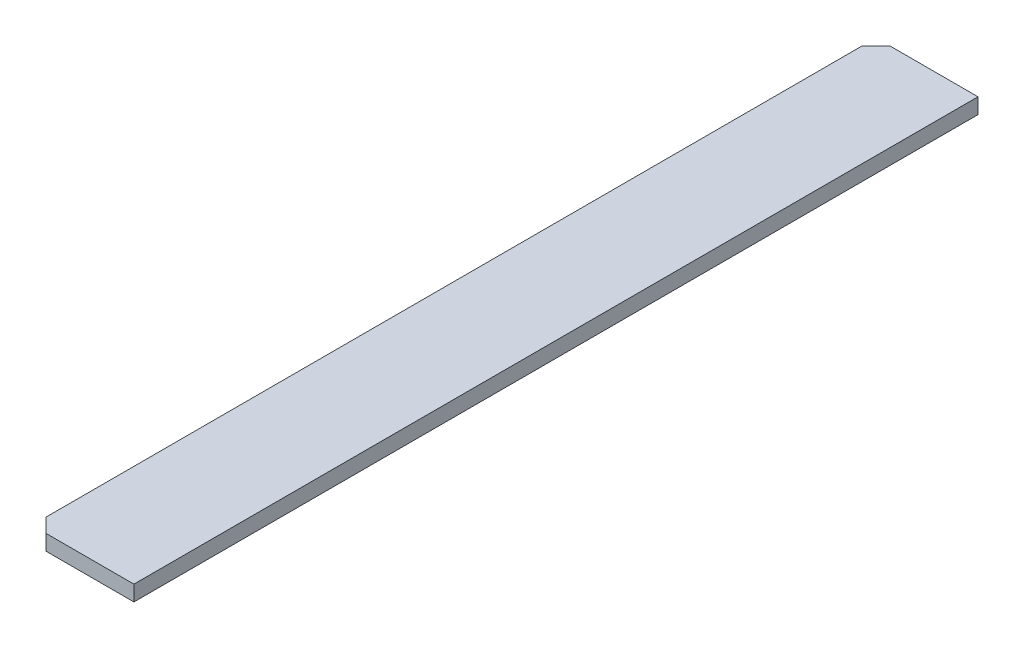
ISO-10303-21;
HEADER;
FILE_DESCRIPTION(('STEP AP214'),'2;1');
FILE_NAME('part.step','',(''),(''),'','','');
FILE_SCHEMA(('AUTOMOTIVE_DESIGN { 1 0 10303 214 1 1 1 1 }'));
ENDSEC;
DATA;
#1=APPLICATION_CONTEXT('core data for automotive mechanical design processes');
#2=APPLICATION_PROTOCOL_DEFINITION('international standard','automotive_design',2000,#1);
#3=PRODUCT_CONTEXT('',#1,'mechanical');
#4=PRODUCT('Part','Part','',(#3));
#5=PRODUCT_RELATED_PRODUCT_CATEGORY('part','',(#4));
#6=PRODUCT_DEFINITION_FORMATION('','',#4);
#7=PRODUCT_DEFINITION_CONTEXT('part definition',#1,'design');
#8=PRODUCT_DEFINITION('design','',#6,#7);
#9=PRODUCT_DEFINITION_SHAPE('','',#8);
#10=(LENGTH_UNIT() NAMED_UNIT(*) SI_UNIT(.MILLI.,.METRE.));
#11=(NAMED_UNIT(*) PLANE_ANGLE_UNIT() SI_UNIT($,.RADIAN.));
#12=(NAMED_UNIT(*) SI_UNIT($,.STERADIAN.) SOLID_ANGLE_UNIT());
#13=UNCERTAINTY_MEASURE_WITH_UNIT(LENGTH_MEASURE(1.E-05),#10,'distance_accuracy_value','');
#14=(GEOMETRIC_REPRESENTATION_CONTEXT(3) GLOBAL_UNCERTAINTY_ASSIGNED_CONTEXT((#13)) GLOBAL_UNIT_ASSIGNED_CONTEXT((#10,
#11,#12)) REPRESENTATION_CONTEXT('',''));
#15=CARTESIAN_POINT('',(0.,0.,0.));
#16=DIRECTION('',(0.,0.,1.));
#17=DIRECTION('',(1.,0.,0.));
#18=AXIS2_PLACEMENT_3D('',#15,#16,#17);
#19=CARTESIAN_POINT('',(-72.5000000000001,22.,-580.));
#20=DIRECTION('',(1.,0.,0.));
#21=DIRECTION('',(0.,0.,-1.));
#22=AXIS2_PLACEMENT_3D('',#19,#20,#21);
#23=PLANE('',#22);
#24=DIRECTION('',(0.,-0.632455532033672,-0.774596669241487));
#25=VECTOR('',#24,1.);
#26=CARTESIAN_POINT('',(-72.5,-58.0846922834923,-514.61112256588));
#27=LINE('',#26,#25);
#28=CARTESIAN_POINT('',(-72.4999999999976,10.9999999999999,-430.000000000003));
#29=VERTEX_POINT('',#28);
#30=CARTESIAN_POINT('',(-72.5,0.,-443.472193585314));
#31=VERTEX_POINT('',#30);
#32=EDGE_CURVE('E173',#29,#31,#27,.T.);
#33=ORIENTED_EDGE('',*,*,#32,.F.);
#34=DIRECTION('',(0.,0.,1.));
#35=VECTOR('',#34,1.);
#36=CARTESIAN_POINT('',(-72.4999999999976,10.9999999999999,-430.000000000003));
#37=LINE('',#36,#35);
#38=CARTESIAN_POINT('',(-72.4999999999976,10.9999999999999,-97.4999999999983));
#39=VERTEX_POINT('',#38);
#40=EDGE_CURVE('E130',#29,#39,#37,.T.);
#41=ORIENTED_EDGE('',*,*,#40,.T.);
#42=DIRECTION('',(0.,0.632455532033672,-0.774596669241487));
#43=VECTOR('',#42,1.);
#44=CARTESIAN_POINT('',(-72.5,251.775760178578,-392.388877434124));
#45=LINE('',#44,#43);
#46=CARTESIAN_POINT('',(-72.5,0.,-84.0278064146879));
#47=VERTEX_POINT('',#46);
#48=EDGE_CURVE('E120',#39,#47,#45,.F.);
#49=ORIENTED_EDGE('',*,*,#48,.T.);
#50=DIRECTION('',(0.,0.,1.));
#51=VECTOR('',#50,1.);
#52=CARTESIAN_POINT('',(-72.5000000000001,0.,-580.));
#53=LINE('',#52,#51);
#54=CARTESIAN_POINT('',(-72.5,0.,84.0278064146881));
#55=VERTEX_POINT('',#54);
#56=EDGE_CURVE('E128',#47,#55,#53,.T.);
#57=ORIENTED_EDGE('',*,*,#56,.T.);
#58=DIRECTION('',(0.,0.632455532033672,0.774596669241487));
#59=VECTOR('',#58,1.);
#60=CARTESIAN_POINT('',(-72.5,11.0000000000013,97.4999999999972));
#61=LINE('',#60,#59);
#62=CARTESIAN_POINT('',(-72.4999999999976,10.9999999999999,97.4999999999983));
#63=VERTEX_POINT('',#62);
#64=EDGE_CURVE('E167',#63,#55,#61,.F.);
#65=ORIENTED_EDGE('',*,*,#64,.F.);
#66=DIRECTION('',(0.,0.,-1.));
#67=VECTOR('',#66,1.);
#68=CARTESIAN_POINT('',(-72.4999999999976,10.9999999999999,430.000000000003));
#69=LINE('',#68,#67);
#70=CARTESIAN_POINT('',(-72.4999999999976,10.9999999999999,430.000000000003));
#71=VERTEX_POINT('',#70);
#72=EDGE_CURVE('E185',#71,#63,#69,.T.);
#73=ORIENTED_EDGE('',*,*,#72,.F.);
#74=DIRECTION('',(0.,-0.632455532033672,0.774596669241487));
#75=VECTOR('',#74,1.);
#76=CARTESIAN_POINT('',(-72.4999999999999,11.0000000000013,430.000000000004));
#77=LINE('',#76,#75);
#78=CARTESIAN_POINT('',(-72.4999999999999,0.,443.472193585314));
#79=VERTEX_POINT('',#78);
#80=EDGE_CURVE('E174',#71,#79,#77,.T.);
#81=ORIENTED_EDGE('',*,*,#80,.T.);
#82=CARTESIAN_POINT('',(-72.4999999999999,0.,580.));
#83=VERTEX_POINT('',#82);
#84=EDGE_CURVE('E138',#79,#83,#53,.T.);
#85=ORIENTED_EDGE('',*,*,#84,.T.);
#86=DIRECTION('',(0.,-1.,0.));
#87=VECTOR('',#86,1.);
#88=CARTESIAN_POINT('',(-72.4999999999999,22.,580.));
#89=LINE('',#88,#87);
#90=CARTESIAN_POINT('',(-72.4999999999999,22.,580.));
#91=VERTEX_POINT('',#90);
#92=EDGE_CURVE('E157',#91,#83,#89,.T.);
#93=ORIENTED_EDGE('',*,*,#92,.F.);
#94=DIRECTION('',(0.,0.,1.));
#95=VECTOR('',#94,1.);
#96=CARTESIAN_POINT('',(-72.5000000000001,22.,-580.));
#97=LINE('',#96,#95);
#98=CARTESIAN_POINT('',(-72.5000000000001,22.,-580.));
#99=VERTEX_POINT('',#98);
#100=EDGE_CURVE('E196',#99,#91,#97,.T.);
#101=ORIENTED_EDGE('',*,*,#100,.F.);
#102=DIRECTION('',(0.,-1.,0.));
#103=VECTOR('',#102,1.);
#104=CARTESIAN_POINT('',(-72.5000000000001,22.,-580.));
#105=LINE('',#104,#103);
#106=CARTESIAN_POINT('',(-72.5000000000001,0.,-580.));
#107=VERTEX_POINT('',#106);
#108=EDGE_CURVE('E160',#99,#107,#105,.T.);
#109=ORIENTED_EDGE('',*,*,#108,.T.);
#110=EDGE_CURVE('E137',#107,#31,#53,.T.);
#111=ORIENTED_EDGE('',*,*,#110,.T.);
#112=EDGE_LOOP('',(#33,#41,#49,#57,#65,#73,#81,#85,#93,#101,#109,#111));
#113=FACE_BOUND('',#112,.T.);
#114=ADVANCED_FACE('F32',(#113),#23,.F.);
#115=CARTESIAN_POINT('',(72.5000000000001,0.,600.));
#116=DIRECTION('',(0.,1.,0.));
#117=DIRECTION('',(0.,0.,1.));
#118=AXIS2_PLACEMENT_3D('',#115,#116,#117);
#119=PLANE('',#118);
#120=DIRECTION('',(0.632455532033676,0.,0.774596669241483));
#121=VECTOR('',#120,1.);
#122=CARTESIAN_POINT('',(496.694887013338,0.,253.646325106587));
#123=LINE('',#122,#121);
#124=CARTESIAN_POINT('',(-61.4999999999976,0.,-430.000000000003));
#125=VERTEX_POINT('',#124);
#126=EDGE_CURVE('E170',#31,#125,#123,.T.);
#127=ORIENTED_EDGE('',*,*,#126,.F.);
#128=ORIENTED_EDGE('',*,*,#110,.F.);
#129=DIRECTION('',(-0.707106781186547,0.,0.707106781186548));
#130=VECTOR('',#129,1.);
#131=CARTESIAN_POINT('',(-72.5000000000001,0.,-580.));
#132=LINE('',#131,#130);
#133=CARTESIAN_POINT('',(-52.5000000000001,0.,-600.));
#134=VERTEX_POINT('',#133);
#135=EDGE_CURVE('E142',#134,#107,#132,.T.);
#136=ORIENTED_EDGE('',*,*,#135,.F.);
#137=DIRECTION('',(-1.,0.,0.));
#138=VECTOR('',#137,1.);
#139=CARTESIAN_POINT('',(-52.5000000000001,0.,-600.));
#140=LINE('',#139,#138);
#141=CARTESIAN_POINT('',(72.4999999999999,0.,-600.));
#142=VERTEX_POINT('',#141);
#143=EDGE_CURVE('E83',#142,#134,#140,.T.);
#144=ORIENTED_EDGE('',*,*,#143,.F.);
#145=DIRECTION('',(0.,0.,-1.));
#146=VECTOR('',#145,1.);
#147=CARTESIAN_POINT('',(72.4999999999999,0.,-600.));
#148=LINE('',#147,#146);
#149=CARTESIAN_POINT('',(72.5000000000001,0.,600.));
#150=VERTEX_POINT('',#149);
#151=EDGE_CURVE('E187',#150,#142,#148,.T.);
#152=ORIENTED_EDGE('',*,*,#151,.F.);
#153=DIRECTION('',(1.,0.,0.));
#154=VECTOR('',#153,1.);
#155=CARTESIAN_POINT('',(-52.4999999999999,0.,600.));
#156=LINE('',#155,#154);
#157=CARTESIAN_POINT('',(-52.4999999999999,0.,600.));
#158=VERTEX_POINT('',#157);
#159=EDGE_CURVE('E147',#158,#150,#156,.T.);
#160=ORIENTED_EDGE('',*,*,#159,.F.);
#161=DIRECTION('',(0.707106781186547,0.,0.707106781186548));
#162=VECTOR('',#161,1.);
#163=CARTESIAN_POINT('',(-72.4999999999999,0.,580.));
#164=LINE('',#163,#162);
#165=EDGE_CURVE('E141',#83,#158,#164,.T.);
#166=ORIENTED_EDGE('',*,*,#165,.F.);
#167=ORIENTED_EDGE('',*,*,#84,.F.);
#168=DIRECTION('',(0.632455532033676,0.,-0.774596669241483));
#169=VECTOR('',#168,1.);
#170=CARTESIAN_POINT('',(-65.8999999999976,0.,435.388877434126));
#171=LINE('',#170,#169);
#172=CARTESIAN_POINT('',(-61.4999999999976,0.,430.000000000003));
#173=VERTEX_POINT('',#172);
#174=EDGE_CURVE('E36',#79,#173,#171,.T.);
#175=ORIENTED_EDGE('',*,*,#174,.T.);
#176=DIRECTION('',(0.,0.,-1.));
#177=VECTOR('',#176,1.);
#178=CARTESIAN_POINT('',(-61.4999999999976,0.,430.000000000003));
#179=LINE('',#178,#177);
#180=CARTESIAN_POINT('',(-61.4999999999976,0.,97.4999999999983));
#181=VERTEX_POINT('',#180);
#182=EDGE_CURVE('E75',#173,#181,#179,.T.);
#183=ORIENTED_EDGE('',*,*,#182,.T.);
#184=DIRECTION('',(-0.632455532033676,0.,-0.774596669241483));
#185=VECTOR('',#184,1.);
#186=CARTESIAN_POINT('',(-65.8999999999976,0.,92.1111225658753));
#187=LINE('',#186,#185);
#188=EDGE_CURVE('E136',#55,#181,#187,.F.);
#189=ORIENTED_EDGE('',*,*,#188,.F.);
#190=ORIENTED_EDGE('',*,*,#56,.F.);
#191=DIRECTION('',(-0.632455532033676,0.,0.774596669241483));
#192=VECTOR('',#191,1.);
#193=CARTESIAN_POINT('',(-349.603819118251,0.,255.353674893413));
#194=LINE('',#193,#192);
#195=CARTESIAN_POINT('',(-61.4999999999976,0.,-97.4999999999983));
#196=VERTEX_POINT('',#195);
#197=EDGE_CURVE('E117',#47,#196,#194,.F.);
#198=ORIENTED_EDGE('',*,*,#197,.T.);
#199=DIRECTION('',(0.,0.,1.));
#200=VECTOR('',#199,1.);
#201=CARTESIAN_POINT('',(-61.4999999999976,0.,-430.000000000003));
#202=LINE('',#201,#200);
#203=EDGE_CURVE('E180',#125,#196,#202,.T.);
#204=ORIENTED_EDGE('',*,*,#203,.F.);
#205=EDGE_LOOP('',(#127,#128,#136,#144,#152,#160,#166,#167,#175,#183,#189,#190,#198,#204));
#206=FACE_BOUND('',#205,.T.);
#207=ADVANCED_FACE('F135',(#206),#119,.F.);
#208=CARTESIAN_POINT('',(72.4999999999999,22.,-600.));
#209=DIRECTION('',(-1.,0.,0.));
#210=DIRECTION('',(0.,0.,1.));
#211=AXIS2_PLACEMENT_3D('',#208,#209,#210);
#212=PLANE('',#211);
#213=ORIENTED_EDGE('',*,*,#151,.T.);
#214=DIRECTION('',(0.,-1.,0.));
#215=VECTOR('',#214,1.);
#216=CARTESIAN_POINT('',(72.4999999999999,22.,-600.));
#217=LINE('',#216,#215);
#218=CARTESIAN_POINT('',(72.4999999999999,22.,-600.));
#219=VERTEX_POINT('',#218);
#220=EDGE_CURVE('E11',#219,#142,#217,.T.);
#221=ORIENTED_EDGE('',*,*,#220,.F.);
#222=DIRECTION('',(0.,0.,-1.));
#223=VECTOR('',#222,1.);
#224=CARTESIAN_POINT('',(72.4999999999999,22.,-600.));
#225=LINE('',#224,#223);
#226=CARTESIAN_POINT('',(72.5000000000001,22.,600.));
#227=VERTEX_POINT('',#226);
#228=EDGE_CURVE('E149',#227,#219,#225,.T.);
#229=ORIENTED_EDGE('',*,*,#228,.F.);
#230=DIRECTION('',(0.,-1.,0.));
#231=VECTOR('',#230,1.);
#232=CARTESIAN_POINT('',(72.5000000000001,22.,600.));
#233=LINE('',#232,#231);
#234=EDGE_CURVE('E150',#227,#150,#233,.T.);
#235=ORIENTED_EDGE('',*,*,#234,.T.);
#236=EDGE_LOOP('',(#213,#221,#229,#235));
#237=FACE_BOUND('',#236,.T.);
#238=ADVANCED_FACE('F237',(#237),#212,.F.);
#239=CARTESIAN_POINT('',(-52.5000000000001,22.,-600.));
#240=DIRECTION('',(0.,0.,1.));
#241=DIRECTION('',(1.,0.,0.));
#242=AXIS2_PLACEMENT_3D('',#239,#240,#241);
#243=PLANE('',#242);
#244=ORIENTED_EDGE('',*,*,#143,.T.);
#245=DIRECTION('',(0.,-1.,0.));
#246=VECTOR('',#245,1.);
#247=CARTESIAN_POINT('',(-52.5000000000001,22.,-600.));
#248=LINE('',#247,#246);
#249=CARTESIAN_POINT('',(-52.5000000000001,22.,-600.));
#250=VERTEX_POINT('',#249);
#251=EDGE_CURVE('E42',#250,#134,#248,.T.);
#252=ORIENTED_EDGE('',*,*,#251,.F.);
#253=DIRECTION('',(-1.,0.,0.));
#254=VECTOR('',#253,1.);
#255=CARTESIAN_POINT('',(-52.5000000000001,22.,-600.));
#256=LINE('',#255,#254);
#257=EDGE_CURVE('E190',#219,#250,#256,.T.);
#258=ORIENTED_EDGE('',*,*,#257,.F.);
#259=ORIENTED_EDGE('',*,*,#220,.T.);
#260=EDGE_LOOP('',(#244,#252,#258,#259));
#261=FACE_BOUND('',#260,.T.);
#262=ADVANCED_FACE('F245',(#261),#243,.F.);
#263=CARTESIAN_POINT('',(-72.5000000000001,22.,-580.));
#264=DIRECTION('',(0.707106781186548,0.,0.707106781186547));
#265=DIRECTION('',(0.707106781186547,0.,-0.707106781186548));
#266=AXIS2_PLACEMENT_3D('',#263,#264,#265);
#267=PLANE('',#266);
#268=ORIENTED_EDGE('',*,*,#135,.T.);
#269=ORIENTED_EDGE('',*,*,#108,.F.);
#270=DIRECTION('',(-0.707106781186547,0.,0.707106781186548));
#271=VECTOR('',#270,1.);
#272=CARTESIAN_POINT('',(-72.5000000000001,22.,-580.));
#273=LINE('',#272,#271);
#274=EDGE_CURVE('E193',#250,#99,#273,.T.);
#275=ORIENTED_EDGE('',*,*,#274,.F.);
#276=ORIENTED_EDGE('',*,*,#251,.T.);
#277=EDGE_LOOP('',(#268,#269,#275,#276));
#278=FACE_BOUND('',#277,.T.);
#279=ADVANCED_FACE('F209',(#278),#267,.F.);
#280=CARTESIAN_POINT('',(-72.4999999999999,22.,580.));
#281=DIRECTION('',(0.707106781186548,0.,-0.707106781186547));
#282=DIRECTION('',(-0.707106781186547,0.,-0.707106781186548));
#283=AXIS2_PLACEMENT_3D('',#280,#281,#282);
#284=PLANE('',#283);
#285=ORIENTED_EDGE('',*,*,#165,.T.);
#286=DIRECTION('',(0.,-1.,0.));
#287=VECTOR('',#286,1.);
#288=CARTESIAN_POINT('',(-52.4999999999999,22.,600.));
#289=LINE('',#288,#287);
#290=CARTESIAN_POINT('',(-52.4999999999999,22.,600.));
#291=VERTEX_POINT('',#290);
#292=EDGE_CURVE('E153',#291,#158,#289,.T.);
#293=ORIENTED_EDGE('',*,*,#292,.F.);
#294=DIRECTION('',(0.707106781186547,0.,0.707106781186548));
#295=VECTOR('',#294,1.);
#296=CARTESIAN_POINT('',(-72.4999999999999,22.,580.));
#297=LINE('',#296,#295);
#298=EDGE_CURVE('E199',#91,#291,#297,.T.);
#299=ORIENTED_EDGE('',*,*,#298,.F.);
#300=ORIENTED_EDGE('',*,*,#92,.T.);
#301=EDGE_LOOP('',(#285,#293,#299,#300));
#302=FACE_BOUND('',#301,.T.);
#303=ADVANCED_FACE('F241',(#302),#284,.F.);
#304=CARTESIAN_POINT('',(-52.4999999999999,22.,600.));
#305=DIRECTION('',(0.,0.,-1.));
#306=DIRECTION('',(-1.,0.,0.));
#307=AXIS2_PLACEMENT_3D('',#304,#305,#306);
#308=PLANE('',#307);
#309=ORIENTED_EDGE('',*,*,#159,.T.);
#310=ORIENTED_EDGE('',*,*,#234,.F.);
#311=DIRECTION('',(1.,0.,0.));
#312=VECTOR('',#311,1.);
#313=CARTESIAN_POINT('',(-52.4999999999999,22.,600.));
#314=LINE('',#313,#312);
#315=EDGE_CURVE('E154',#291,#227,#314,.T.);
#316=ORIENTED_EDGE('',*,*,#315,.F.);
#317=ORIENTED_EDGE('',*,*,#292,.T.);
#318=EDGE_LOOP('',(#309,#310,#316,#317));
#319=FACE_BOUND('',#318,.T.);
#320=ADVANCED_FACE('F299',(#319),#308,.F.);
#321=CARTESIAN_POINT('',(72.5000000000001,22.,600.));
#322=DIRECTION('',(0.,1.,0.));
#323=DIRECTION('',(0.,0.,1.));
#324=AXIS2_PLACEMENT_3D('',#321,#322,#323);
#325=PLANE('',#324);
#326=ORIENTED_EDGE('',*,*,#228,.T.);
#327=ORIENTED_EDGE('',*,*,#257,.T.);
#328=ORIENTED_EDGE('',*,*,#274,.T.);
#329=ORIENTED_EDGE('',*,*,#100,.T.);
#330=ORIENTED_EDGE('',*,*,#298,.T.);
#331=ORIENTED_EDGE('',*,*,#315,.T.);
#332=EDGE_LOOP('',(#326,#327,#328,#329,#330,#331));
#333=FACE_BOUND('',#332,.T.);
#334=ADVANCED_FACE('F293',(#333),#325,.T.);
#335=CARTESIAN_POINT('',(-72.4999999999976,10.9999999999999,430.000000000003));
#336=DIRECTION('',(-0.707106781186544,-0.707106781186551,0.));
#337=DIRECTION('',(0.707106781186551,-0.707106781186544,0.));
#338=AXIS2_PLACEMENT_3D('',#335,#336,#337);
#339=PLANE('',#338);
#340=DIRECTION('',(-0.707106781186551,0.707106781186544,0.));
#341=VECTOR('',#340,1.);
#342=CARTESIAN_POINT('',(-72.4999999999976,10.9999999999999,97.4999999999983));
#343=LINE('',#342,#341);
#344=EDGE_CURVE('E169',#181,#63,#343,.T.);
#345=ORIENTED_EDGE('',*,*,#344,.F.);
#346=ORIENTED_EDGE('',*,*,#182,.F.);
#347=DIRECTION('',(-0.707106781186551,0.707106781186544,0.));
#348=VECTOR('',#347,1.);
#349=CARTESIAN_POINT('',(-72.4999999999976,10.9999999999999,430.000000000003));
#350=LINE('',#349,#348);
#351=EDGE_CURVE('E166',#173,#71,#350,.T.);
#352=ORIENTED_EDGE('',*,*,#351,.T.);
#353=ORIENTED_EDGE('',*,*,#72,.T.);
#354=EDGE_LOOP('',(#345,#346,#352,#353));
#355=FACE_BOUND('',#354,.T.);
#356=ADVANCED_FACE('F287',(#355),#339,.T.);
#357=CARTESIAN_POINT('',(-72.4999999999976,10.9999999999999,430.000000000003));
#358=DIRECTION('',(-0.612372435695792,-0.612372435695799,-0.499999999999998));
#359=DIRECTION('',(0.707106781186551,-0.707106781186544,0.));
#360=AXIS2_PLACEMENT_3D('',#357,#358,#359);
#361=PLANE('',#360);
#362=ORIENTED_EDGE('',*,*,#351,.F.);
#363=ORIENTED_EDGE('',*,*,#174,.F.);
#364=ORIENTED_EDGE('',*,*,#80,.F.);
#365=EDGE_LOOP('',(#362,#363,#364));
#366=FACE_BOUND('',#365,.T.);
#367=ADVANCED_FACE('F34',(#366),#361,.T.);
#368=CARTESIAN_POINT('',(-72.4999999999976,10.9999999999999,97.4999999999983));
#369=DIRECTION('',(-0.612372435695792,-0.612372435695799,0.499999999999998));
#370=DIRECTION('',(0.707106781186551,-0.707106781186544,0.));
#371=AXIS2_PLACEMENT_3D('',#368,#369,#370);
#372=PLANE('',#371);
#373=ORIENTED_EDGE('',*,*,#344,.T.);
#374=ORIENTED_EDGE('',*,*,#64,.T.);
#375=ORIENTED_EDGE('',*,*,#188,.T.);
#376=EDGE_LOOP('',(#373,#374,#375));
#377=FACE_BOUND('',#376,.T.);
#378=ADVANCED_FACE('F222',(#377),#372,.T.);
#379=CARTESIAN_POINT('',(-72.4999999999976,10.9999999999999,-430.000000000003));
#380=DIRECTION('',(0.707106781186544,0.707106781186551,0.));
#381=DIRECTION('',(-0.707106781186551,0.707106781186544,0.));
#382=AXIS2_PLACEMENT_3D('',#379,#380,#381);
#383=PLANE('',#382);
#384=DIRECTION('',(-0.707106781186551,0.707106781186544,0.));
#385=VECTOR('',#384,1.);
#386=CARTESIAN_POINT('',(-72.4999999999976,10.9999999999999,-97.4999999999983));
#387=LINE('',#386,#385);
#388=EDGE_CURVE('E51',#196,#39,#387,.T.);
#389=ORIENTED_EDGE('',*,*,#388,.T.);
#390=ORIENTED_EDGE('',*,*,#40,.F.);
#391=DIRECTION('',(-0.707106781186551,0.707106781186544,0.));
#392=VECTOR('',#391,1.);
#393=CARTESIAN_POINT('',(-72.4999999999976,10.9999999999999,-430.000000000003));
#394=LINE('',#393,#392);
#395=EDGE_CURVE('E131',#125,#29,#394,.T.);
#396=ORIENTED_EDGE('',*,*,#395,.F.);
#397=ORIENTED_EDGE('',*,*,#203,.T.);
#398=EDGE_LOOP('',(#389,#390,#396,#397));
#399=FACE_BOUND('',#398,.T.);
#400=ADVANCED_FACE('F220',(#399),#383,.F.);
#401=CARTESIAN_POINT('',(-72.4999999999976,10.9999999999999,-430.000000000003));
#402=DIRECTION('',(-0.612372435695792,-0.612372435695799,0.499999999999998));
#403=DIRECTION('',(0.707106781186551,-0.707106781186544,0.));
#404=AXIS2_PLACEMENT_3D('',#401,#402,#403);
#405=PLANE('',#404);
#406=ORIENTED_EDGE('',*,*,#395,.T.);
#407=ORIENTED_EDGE('',*,*,#32,.T.);
#408=ORIENTED_EDGE('',*,*,#126,.T.);
#409=EDGE_LOOP('',(#406,#407,#408));
#410=FACE_BOUND('',#409,.T.);
#411=ADVANCED_FACE('F217',(#410),#405,.T.);
#412=CARTESIAN_POINT('',(-72.4999999999976,10.9999999999999,-97.4999999999983));
#413=DIRECTION('',(-0.612372435695792,-0.612372435695799,-0.499999999999998));
#414=DIRECTION('',(0.707106781186551,-0.707106781186544,0.));
#415=AXIS2_PLACEMENT_3D('',#412,#413,#414);
#416=PLANE('',#415);
#417=ORIENTED_EDGE('',*,*,#388,.F.);
#418=ORIENTED_EDGE('',*,*,#197,.F.);
#419=ORIENTED_EDGE('',*,*,#48,.F.);
#420=EDGE_LOOP('',(#417,#418,#419));
#421=FACE_BOUND('',#420,.T.);
#422=ADVANCED_FACE('F119',(#421),#416,.T.);
#423=CLOSED_SHELL('',(#114,#207,#238,#262,#279,#303,#320,#334,#356,#367,#378,#400,#411,#422));
#424=MANIFOLD_SOLID_BREP('B2',#423);
#425=ADVANCED_BREP_SHAPE_REPRESENTATION('',(#18,#424),#14);
#426=SHAPE_DEFINITION_REPRESENTATION(#9,#425);
ENDSEC;
END-ISO-10303-21;
